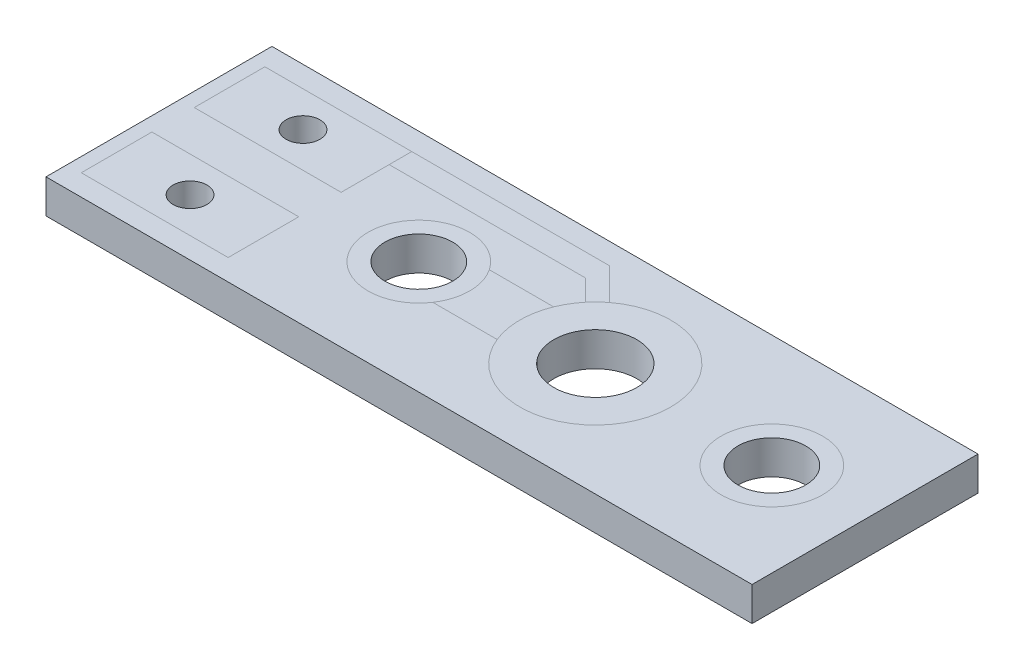
ISO-10303-21;
HEADER;
FILE_DESCRIPTION(('STEP AP214'),'2;1');
FILE_NAME('part.step','',(''),(''),'','','');
FILE_SCHEMA(('AUTOMOTIVE_DESIGN { 1 0 10303 214 1 1 1 1 }'));
ENDSEC;
DATA;
#1=APPLICATION_CONTEXT('core data for automotive mechanical design processes');
#2=APPLICATION_PROTOCOL_DEFINITION('international standard','automotive_design',2000,#1);
#3=PRODUCT_CONTEXT('',#1,'mechanical');
#4=PRODUCT('Part','Part','',(#3));
#5=PRODUCT_RELATED_PRODUCT_CATEGORY('part','',(#4));
#6=PRODUCT_DEFINITION_FORMATION('','',#4);
#7=PRODUCT_DEFINITION_CONTEXT('part definition',#1,'design');
#8=PRODUCT_DEFINITION('design','',#6,#7);
#9=PRODUCT_DEFINITION_SHAPE('','',#8);
#10=(LENGTH_UNIT() NAMED_UNIT(*) SI_UNIT(.MILLI.,.METRE.));
#11=(NAMED_UNIT(*) PLANE_ANGLE_UNIT() SI_UNIT($,.RADIAN.));
#12=(NAMED_UNIT(*) SI_UNIT($,.STERADIAN.) SOLID_ANGLE_UNIT());
#13=UNCERTAINTY_MEASURE_WITH_UNIT(LENGTH_MEASURE(1.E-05),#10,'distance_accuracy_value','');
#14=(GEOMETRIC_REPRESENTATION_CONTEXT(3) GLOBAL_UNCERTAINTY_ASSIGNED_CONTEXT((#13)) GLOBAL_UNIT_ASSIGNED_CONTEXT((#10,
#11,#12)) REPRESENTATION_CONTEXT('',''));
#15=CARTESIAN_POINT('',(0.,0.,0.));
#16=DIRECTION('',(0.,0.,1.));
#17=DIRECTION('',(1.,0.,0.));
#18=AXIS2_PLACEMENT_3D('',#15,#16,#17);
#19=CARTESIAN_POINT('',(0.,-0.762,0.));
#20=DIRECTION('',(0.,1.,0.));
#21=DIRECTION('',(0.,0.,-1.));
#22=AXIS2_PLACEMENT_3D('',#19,#20,#21);
#23=PLANE('',#22);
#24=DIRECTION('',(1.,0.,0.));
#25=VECTOR('',#24,1.);
#26=CARTESIAN_POINT('',(0.,-0.762,1.27));
#27=LINE('',#26,#25);
#28=CARTESIAN_POINT('',(6.89059014024725,-0.762,1.27));
#29=VERTEX_POINT('',#28);
#30=CARTESIAN_POINT('',(9.78323804751884,-0.762,1.27));
#31=VERTEX_POINT('',#30);
#32=EDGE_CURVE('E11',#29,#31,#27,.T.);
#33=ORIENTED_EDGE('',*,*,#32,.F.);
#34=CARTESIAN_POINT('',(3.7465,-0.762,0.));
#35=DIRECTION('',(0.,-1.,0.));
#36=DIRECTION('',(0.,0.,-1.));
#37=AXIS2_PLACEMENT_3D('',#34,#35,#36);
#38=CIRCLE('',#37,3.3909);
#39=CARTESIAN_POINT('',(6.89059014024725,-0.762,-1.27));
#40=VERTEX_POINT('',#39);
#41=EDGE_CURVE('E266',#29,#40,#38,.F.);
#42=ORIENTED_EDGE('',*,*,#41,.T.);
#43=DIRECTION('',(1.,0.,0.));
#44=VECTOR('',#43,1.);
#45=CARTESIAN_POINT('',(0.,-0.762,-1.27));
#46=LINE('',#45,#44);
#47=CARTESIAN_POINT('',(9.78323804751884,-0.762,-1.27));
#48=VERTEX_POINT('',#47);
#49=EDGE_CURVE('E53',#40,#48,#46,.T.);
#50=ORIENTED_EDGE('',*,*,#49,.T.);
#51=CARTESIAN_POINT('',(11.684,-0.762,0.));
#52=DIRECTION('',(0.,-1.,0.));
#53=DIRECTION('',(0.,0.,-1.));
#54=AXIS2_PLACEMENT_3D('',#51,#52,#53);
#55=CIRCLE('',#54,2.286);
#56=EDGE_CURVE('E267',#48,#31,#55,.F.);
#57=ORIENTED_EDGE('',*,*,#56,.T.);
#58=EDGE_LOOP('',(#33,#42,#50,#57));
#59=FACE_BOUND('',#58,.T.);
#60=ADVANCED_FACE('F44',(#59),#23,.F.);
#61=CARTESIAN_POINT('',(-4.191,-0.762,0.));
#62=DIRECTION('',(0.,-1.,0.));
#63=DIRECTION('',(0.,0.,-1.));
#64=AXIS2_PLACEMENT_3D('',#61,#62,#63);
#65=CIRCLE('',#64,2.286);
#66=CARTESIAN_POINT('',(-4.191,-0.762,-2.286));
#67=VERTEX_POINT('',#66);
#68=EDGE_CURVE('E257',#67,#67,#65,.F.);
#69=ORIENTED_EDGE('',*,*,#68,.T.);
#70=EDGE_LOOP('',(#69));
#71=FACE_BOUND('',#70,.T.);
#72=DIRECTION('',(-1.,0.,0.));
#73=VECTOR('',#72,1.);
#74=CARTESIAN_POINT('',(0.,-0.762,-0.952500000000002));
#75=LINE('',#74,#73);
#76=CARTESIAN_POINT('',(-8.636,-0.762,-0.952500000000002));
#77=VERTEX_POINT('',#76);
#78=CARTESIAN_POINT('',(-15.24,-0.762,-0.952500000000003));
#79=VERTEX_POINT('',#78);
#80=EDGE_CURVE('E250',#77,#79,#75,.T.);
#81=ORIENTED_EDGE('',*,*,#80,.F.);
#82=DIRECTION('',(0.,0.,1.));
#83=VECTOR('',#82,1.);
#84=CARTESIAN_POINT('',(-8.636,-0.762,0.));
#85=LINE('',#84,#83);
#86=CARTESIAN_POINT('',(-8.636,-0.762,-4.1275));
#87=VERTEX_POINT('',#86);
#88=EDGE_CURVE('E247',#87,#77,#85,.T.);
#89=ORIENTED_EDGE('',*,*,#88,.F.);
#90=DIRECTION('',(1.,0.,0.));
#91=VECTOR('',#90,1.);
#92=CARTESIAN_POINT('',(0.,-0.762,-4.1275));
#93=LINE('',#92,#91);
#94=CARTESIAN_POINT('',(-15.24,-0.762,-4.1275));
#95=VERTEX_POINT('',#94);
#96=EDGE_CURVE('E244',#95,#87,#93,.T.);
#97=ORIENTED_EDGE('',*,*,#96,.F.);
#98=DIRECTION('',(0.,0.,-1.));
#99=VECTOR('',#98,1.);
#100=CARTESIAN_POINT('',(-15.24,-0.762,0.));
#101=LINE('',#100,#99);
#102=EDGE_CURVE('E254',#79,#95,#101,.T.);
#103=ORIENTED_EDGE('',*,*,#102,.F.);
#104=EDGE_LOOP('',(#81,#89,#97,#103));
#105=FACE_BOUND('',#104,.T.);
#106=DIRECTION('',(0.,0.,1.));
#107=VECTOR('',#106,1.);
#108=CARTESIAN_POINT('',(-15.875,-0.762,-5.07999999999999));
#109=LINE('',#108,#107);
#110=CARTESIAN_POINT('',(-15.875,-0.762,-5.07999999999999));
#111=VERTEX_POINT('',#110);
#112=CARTESIAN_POINT('',(-15.875,-0.762,5.08));
#113=VERTEX_POINT('',#112);
#114=EDGE_CURVE('E204',#111,#113,#109,.T.);
#115=ORIENTED_EDGE('',*,*,#114,.F.);
#116=DIRECTION('',(-1.,0.,0.));
#117=VECTOR('',#116,1.);
#118=CARTESIAN_POINT('',(15.875,-0.762,-5.08));
#119=LINE('',#118,#117);
#120=CARTESIAN_POINT('',(15.875,-0.762,-5.08));
#121=VERTEX_POINT('',#120);
#122=EDGE_CURVE('E225',#121,#111,#119,.T.);
#123=ORIENTED_EDGE('',*,*,#122,.F.);
#124=DIRECTION('',(0.,0.,-1.));
#125=VECTOR('',#124,1.);
#126=CARTESIAN_POINT('',(15.875,-0.762,-5.08));
#127=LINE('',#126,#125);
#128=CARTESIAN_POINT('',(15.875,-0.762,5.08));
#129=VERTEX_POINT('',#128);
#130=EDGE_CURVE('E206',#129,#121,#127,.T.);
#131=ORIENTED_EDGE('',*,*,#130,.F.);
#132=DIRECTION('',(1.,0.,0.));
#133=VECTOR('',#132,1.);
#134=CARTESIAN_POINT('',(15.875,-0.762,5.08));
#135=LINE('',#134,#133);
#136=EDGE_CURVE('E189',#113,#129,#135,.T.);
#137=ORIENTED_EDGE('',*,*,#136,.F.);
#138=EDGE_LOOP('',(#115,#123,#131,#137));
#139=FACE_BOUND('',#138,.T.);
#140=CARTESIAN_POINT('',(1.68738577909666,-0.762,2.69411422090334));
#141=VERTEX_POINT('',#140);
#142=EDGE_CURVE('E262',#141,#29,#38,.F.);
#143=ORIENTED_EDGE('',*,*,#142,.T.);
#144=ORIENTED_EDGE('',*,*,#32,.T.);
#145=EDGE_CURVE('E265',#31,#48,#55,.F.);
#146=ORIENTED_EDGE('',*,*,#145,.T.);
#147=ORIENTED_EDGE('',*,*,#49,.F.);
#148=CARTESIAN_POINT('',(1.13769203312162,-0.762,2.16617723235008));
#149=VERTEX_POINT('',#148);
#150=EDGE_CURVE('E406',#40,#149,#38,.F.);
#151=ORIENTED_EDGE('',*,*,#150,.T.);
#152=DIRECTION('',(0.707106781186546,0.,-0.707106781186549));
#153=VECTOR('',#152,1.);
#154=CARTESIAN_POINT('',(1.65193463273585,-0.762,1.65193463273585));
#155=LINE('',#154,#153);
#156=CARTESIAN_POINT('',(0.192369265471702,-0.762,3.1115));
#157=VERTEX_POINT('',#156);
#158=EDGE_CURVE('E377',#157,#149,#155,.T.);
#159=ORIENTED_EDGE('',*,*,#158,.F.);
#160=DIRECTION('',(1.,0.,0.));
#161=VECTOR('',#160,1.);
#162=CARTESIAN_POINT('',(0.,-0.762,3.1115));
#163=LINE('',#162,#161);
#164=CARTESIAN_POINT('',(-8.636,-0.762,3.1115));
#165=VERTEX_POINT('',#164);
#166=EDGE_CURVE('E381',#165,#157,#163,.T.);
#167=ORIENTED_EDGE('',*,*,#166,.F.);
#168=DIRECTION('',(0.,0.,-1.));
#169=VECTOR('',#168,1.);
#170=CARTESIAN_POINT('',(-8.636,-0.762,0.));
#171=LINE('',#170,#169);
#172=CARTESIAN_POINT('',(-8.636,-0.762,0.952500000000002));
#173=VERTEX_POINT('',#172);
#174=EDGE_CURVE('E231',#165,#173,#171,.T.);
#175=ORIENTED_EDGE('',*,*,#174,.T.);
#176=DIRECTION('',(-1.,0.,0.));
#177=VECTOR('',#176,1.);
#178=CARTESIAN_POINT('',(0.,-0.762,0.952500000000002));
#179=LINE('',#178,#177);
#180=CARTESIAN_POINT('',(-15.24,-0.762,0.952500000000003));
#181=VERTEX_POINT('',#180);
#182=EDGE_CURVE('E228',#173,#181,#179,.T.);
#183=ORIENTED_EDGE('',*,*,#182,.T.);
#184=DIRECTION('',(0.,0.,1.));
#185=VECTOR('',#184,1.);
#186=CARTESIAN_POINT('',(-15.24,-0.762,0.));
#187=LINE('',#186,#185);
#188=CARTESIAN_POINT('',(-15.24,-0.762,4.1275));
#189=VERTEX_POINT('',#188);
#190=EDGE_CURVE('E240',#181,#189,#187,.T.);
#191=ORIENTED_EDGE('',*,*,#190,.T.);
#192=DIRECTION('',(1.,0.,0.));
#193=VECTOR('',#192,1.);
#194=CARTESIAN_POINT('',(0.,-0.762,4.1275));
#195=LINE('',#194,#193);
#196=CARTESIAN_POINT('',(-8.636,-0.762,4.1275));
#197=VERTEX_POINT('',#196);
#198=EDGE_CURVE('E236',#189,#197,#195,.T.);
#199=ORIENTED_EDGE('',*,*,#198,.T.);
#200=DIRECTION('',(1.,0.,0.));
#201=VECTOR('',#200,1.);
#202=CARTESIAN_POINT('',(0.,-0.762,4.1275));
#203=LINE('',#202,#201);
#204=CARTESIAN_POINT('',(0.254000000000001,-0.762,4.1275));
#205=VERTEX_POINT('',#204);
#206=EDGE_CURVE('E374',#197,#205,#203,.T.);
#207=ORIENTED_EDGE('',*,*,#206,.T.);
#208=DIRECTION('',(0.707106781186546,0.,-0.707106781186549));
#209=VECTOR('',#208,1.);
#210=CARTESIAN_POINT('',(2.19075,-0.762,2.19074999999999));
#211=LINE('',#210,#209);
#212=EDGE_CURVE('E370',#205,#141,#211,.T.);
#213=ORIENTED_EDGE('',*,*,#212,.T.);
#214=EDGE_LOOP('',(#143,#144,#146,#147,#151,#159,#167,#175,#183,#191,#199,#207,#213));
#215=FACE_BOUND('',#214,.T.);
#216=ADVANCED_FACE('F202',(#71,#105,#139,#215),#23,.F.);
#217=CARTESIAN_POINT('',(0.,0.762,0.));
#218=DIRECTION('',(0.,-1.,0.));
#219=DIRECTION('',(0.,0.,-1.));
#220=AXIS2_PLACEMENT_3D('',#217,#218,#219);
#221=PLANE('',#220);
#222=DIRECTION('',(0.,0.,1.));
#223=VECTOR('',#222,1.);
#224=CARTESIAN_POINT('',(-15.24,0.762,0.));
#225=LINE('',#224,#223);
#226=CARTESIAN_POINT('',(-15.24,0.762,0.952500000000003));
#227=VERTEX_POINT('',#226);
#228=CARTESIAN_POINT('',(-15.24,0.762,4.1275));
#229=VERTEX_POINT('',#228);
#230=EDGE_CURVE('E317',#227,#229,#225,.T.);
#231=ORIENTED_EDGE('',*,*,#230,.F.);
#232=DIRECTION('',(-1.,0.,0.));
#233=VECTOR('',#232,1.);
#234=CARTESIAN_POINT('',(0.,0.762,0.952500000000002));
#235=LINE('',#234,#233);
#236=CARTESIAN_POINT('',(-8.636,0.762,0.952500000000002));
#237=VERTEX_POINT('',#236);
#238=EDGE_CURVE('E197',#237,#227,#235,.T.);
#239=ORIENTED_EDGE('',*,*,#238,.F.);
#240=DIRECTION('',(0.,0.,-1.));
#241=VECTOR('',#240,1.);
#242=CARTESIAN_POINT('',(-8.636,0.762,0.));
#243=LINE('',#242,#241);
#244=CARTESIAN_POINT('',(-8.636,0.762,4.1275));
#245=VERTEX_POINT('',#244);
#246=EDGE_CURVE('E311',#245,#237,#243,.T.);
#247=ORIENTED_EDGE('',*,*,#246,.F.);
#248=DIRECTION('',(1.,0.,0.));
#249=VECTOR('',#248,1.);
#250=CARTESIAN_POINT('',(0.,0.762,4.1275));
#251=LINE('',#250,#249);
#252=EDGE_CURVE('E314',#229,#245,#251,.T.);
#253=ORIENTED_EDGE('',*,*,#252,.F.);
#254=EDGE_LOOP('',(#231,#239,#247,#253));
#255=FACE_BOUND('',#254,.T.);
#256=DIRECTION('',(0.,0.,1.));
#257=VECTOR('',#256,1.);
#258=CARTESIAN_POINT('',(-15.875,0.762,-5.07999999999999));
#259=LINE('',#258,#257);
#260=CARTESIAN_POINT('',(-15.875,0.762,-5.07999999999999));
#261=VERTEX_POINT('',#260);
#262=CARTESIAN_POINT('',(-15.875,0.762,5.08));
#263=VERTEX_POINT('',#262);
#264=EDGE_CURVE('E283',#261,#263,#259,.T.);
#265=ORIENTED_EDGE('',*,*,#264,.T.);
#266=DIRECTION('',(1.,0.,0.));
#267=VECTOR('',#266,1.);
#268=CARTESIAN_POINT('',(15.875,0.762,5.08));
#269=LINE('',#268,#267);
#270=CARTESIAN_POINT('',(15.875,0.762,5.08));
#271=VERTEX_POINT('',#270);
#272=EDGE_CURVE('E191',#263,#271,#269,.T.);
#273=ORIENTED_EDGE('',*,*,#272,.T.);
#274=DIRECTION('',(0.,0.,-1.));
#275=VECTOR('',#274,1.);
#276=CARTESIAN_POINT('',(15.875,0.762,-5.08));
#277=LINE('',#276,#275);
#278=CARTESIAN_POINT('',(15.875,0.762,-5.08));
#279=VERTEX_POINT('',#278);
#280=EDGE_CURVE('E295',#271,#279,#277,.T.);
#281=ORIENTED_EDGE('',*,*,#280,.T.);
#282=DIRECTION('',(-1.,0.,0.));
#283=VECTOR('',#282,1.);
#284=CARTESIAN_POINT('',(15.875,0.762,-5.08));
#285=LINE('',#284,#283);
#286=EDGE_CURVE('E298',#279,#261,#285,.T.);
#287=ORIENTED_EDGE('',*,*,#286,.T.);
#288=EDGE_LOOP('',(#265,#273,#281,#287));
#289=FACE_BOUND('',#288,.T.);
#290=CARTESIAN_POINT('',(11.684,0.762,0.));
#291=DIRECTION('',(0.,-1.,0.));
#292=DIRECTION('',(0.,0.,-1.));
#293=AXIS2_PLACEMENT_3D('',#290,#291,#292);
#294=CIRCLE('',#293,2.286);
#295=CARTESIAN_POINT('',(11.684,0.762,-2.286));
#296=VERTEX_POINT('',#295);
#297=EDGE_CURVE('E346',#296,#296,#294,.F.);
#298=ORIENTED_EDGE('',*,*,#297,.F.);
#299=EDGE_LOOP('',(#298));
#300=FACE_BOUND('',#299,.T.);
#301=DIRECTION('',(1.,0.,0.));
#302=VECTOR('',#301,1.);
#303=CARTESIAN_POINT('',(0.,0.762,-3.1115));
#304=LINE('',#303,#302);
#305=CARTESIAN_POINT('',(-8.636,0.762,-3.1115));
#306=VERTEX_POINT('',#305);
#307=CARTESIAN_POINT('',(0.192369265471702,0.762,-3.1115));
#308=VERTEX_POINT('',#307);
#309=EDGE_CURVE('E367',#306,#308,#304,.T.);
#310=ORIENTED_EDGE('',*,*,#309,.F.);
#311=DIRECTION('',(0.,0.,1.));
#312=VECTOR('',#311,1.);
#313=CARTESIAN_POINT('',(-8.636,0.762,0.));
#314=LINE('',#313,#312);
#315=CARTESIAN_POINT('',(-8.636,0.762,-0.952500000000002));
#316=VERTEX_POINT('',#315);
#317=EDGE_CURVE('E324',#306,#316,#314,.T.);
#318=ORIENTED_EDGE('',*,*,#317,.T.);
#319=DIRECTION('',(-1.,0.,0.));
#320=VECTOR('',#319,1.);
#321=CARTESIAN_POINT('',(0.,0.762,-0.952500000000002));
#322=LINE('',#321,#320);
#323=CARTESIAN_POINT('',(-15.24,0.762,-0.952500000000003));
#324=VERTEX_POINT('',#323);
#325=EDGE_CURVE('E329',#316,#324,#322,.T.);
#326=ORIENTED_EDGE('',*,*,#325,.T.);
#327=DIRECTION('',(0.,0.,-1.));
#328=VECTOR('',#327,1.);
#329=CARTESIAN_POINT('',(-15.24,0.762,0.));
#330=LINE('',#329,#328);
#331=CARTESIAN_POINT('',(-15.24,0.762,-4.1275));
#332=VERTEX_POINT('',#331);
#333=EDGE_CURVE('E333',#324,#332,#330,.T.);
#334=ORIENTED_EDGE('',*,*,#333,.T.);
#335=DIRECTION('',(1.,0.,0.));
#336=VECTOR('',#335,1.);
#337=CARTESIAN_POINT('',(0.,0.762,-4.1275));
#338=LINE('',#337,#336);
#339=CARTESIAN_POINT('',(-8.636,0.762,-4.1275));
#340=VERTEX_POINT('',#339);
#341=EDGE_CURVE('E320',#332,#340,#338,.T.);
#342=ORIENTED_EDGE('',*,*,#341,.T.);
#343=DIRECTION('',(1.,0.,0.));
#344=VECTOR('',#343,1.);
#345=CARTESIAN_POINT('',(0.,0.762,-4.1275));
#346=LINE('',#345,#344);
#347=CARTESIAN_POINT('',(0.254000000000002,0.762,-4.1275));
#348=VERTEX_POINT('',#347);
#349=EDGE_CURVE('E361',#340,#348,#346,.T.);
#350=ORIENTED_EDGE('',*,*,#349,.T.);
#351=DIRECTION('',(0.707106781186546,0.,0.707106781186549));
#352=VECTOR('',#351,1.);
#353=CARTESIAN_POINT('',(2.19075,0.762,-2.19075));
#354=LINE('',#353,#352);
#355=CARTESIAN_POINT('',(1.68738577909666,0.762,-2.69411422090334));
#356=VERTEX_POINT('',#355);
#357=EDGE_CURVE('E358',#348,#356,#354,.T.);
#358=ORIENTED_EDGE('',*,*,#357,.T.);
#359=CARTESIAN_POINT('',(3.7465,0.762,0.));
#360=DIRECTION('',(0.,-1.,0.));
#361=DIRECTION('',(0.,0.,-1.));
#362=AXIS2_PLACEMENT_3D('',#359,#360,#361);
#363=CIRCLE('',#362,3.3909);
#364=CARTESIAN_POINT('',(0.602409859752746,0.762,1.27));
#365=VERTEX_POINT('',#364);
#366=EDGE_CURVE('E347',#365,#356,#363,.F.);
#367=ORIENTED_EDGE('',*,*,#366,.F.);
#368=DIRECTION('',(1.,0.,0.));
#369=VECTOR('',#368,1.);
#370=CARTESIAN_POINT('',(0.,0.762,1.27));
#371=LINE('',#370,#369);
#372=CARTESIAN_POINT('',(-2.29023804751884,0.762,1.27));
#373=VERTEX_POINT('',#372);
#374=EDGE_CURVE('E355',#373,#365,#371,.T.);
#375=ORIENTED_EDGE('',*,*,#374,.F.);
#376=CARTESIAN_POINT('',(-4.191,0.762,0.));
#377=DIRECTION('',(0.,-1.,0.));
#378=DIRECTION('',(0.,0.,-1.));
#379=AXIS2_PLACEMENT_3D('',#376,#377,#378);
#380=CIRCLE('',#379,2.286);
#381=CARTESIAN_POINT('',(-2.29023804751884,0.762,-1.27));
#382=VERTEX_POINT('',#381);
#383=EDGE_CURVE('E337',#382,#373,#380,.F.);
#384=ORIENTED_EDGE('',*,*,#383,.F.);
#385=DIRECTION('',(1.,0.,0.));
#386=VECTOR('',#385,1.);
#387=CARTESIAN_POINT('',(0.,0.762,-1.27));
#388=LINE('',#387,#386);
#389=CARTESIAN_POINT('',(0.602409859752746,0.762,-1.27));
#390=VERTEX_POINT('',#389);
#391=EDGE_CURVE('E351',#382,#390,#388,.T.);
#392=ORIENTED_EDGE('',*,*,#391,.T.);
#393=CARTESIAN_POINT('',(1.13769203312162,0.762,-2.16617723235008));
#394=VERTEX_POINT('',#393);
#395=EDGE_CURVE('E341',#394,#390,#363,.F.);
#396=ORIENTED_EDGE('',*,*,#395,.F.);
#397=DIRECTION('',(0.707106781186546,0.,0.707106781186549));
#398=VECTOR('',#397,1.);
#399=CARTESIAN_POINT('',(1.65193463273585,0.762,-1.65193463273584));
#400=LINE('',#399,#398);
#401=EDGE_CURVE('E364',#308,#394,#400,.T.);
#402=ORIENTED_EDGE('',*,*,#401,.F.);
#403=EDGE_LOOP('',(#310,#318,#326,#334,#342,#350,#358,#367,#375,#384,#392,#396,#402));
#404=FACE_BOUND('',#403,.T.);
#405=ADVANCED_FACE('F493',(#255,#289,#300,#404),#221,.F.);
#406=EDGE_CURVE('E325',#340,#306,#314,.T.);
#407=ORIENTED_EDGE('',*,*,#406,.T.);
#408=ORIENTED_EDGE('',*,*,#309,.T.);
#409=ORIENTED_EDGE('',*,*,#401,.T.);
#410=EDGE_CURVE('E805',#356,#394,#363,.F.);
#411=ORIENTED_EDGE('',*,*,#410,.F.);
#412=ORIENTED_EDGE('',*,*,#357,.F.);
#413=ORIENTED_EDGE('',*,*,#349,.F.);
#414=EDGE_LOOP('',(#407,#408,#409,#411,#412,#413));
#415=FACE_BOUND('',#414,.T.);
#416=ADVANCED_FACE('F499',(#415),#221,.F.);
#417=EDGE_CURVE('E336',#373,#382,#380,.F.);
#418=ORIENTED_EDGE('',*,*,#417,.F.);
#419=ORIENTED_EDGE('',*,*,#374,.T.);
#420=EDGE_CURVE('E342',#390,#365,#363,.F.);
#421=ORIENTED_EDGE('',*,*,#420,.F.);
#422=ORIENTED_EDGE('',*,*,#391,.F.);
#423=EDGE_LOOP('',(#418,#419,#421,#422));
#424=FACE_BOUND('',#423,.T.);
#425=ADVANCED_FACE('F630',(#424),#221,.F.);
#426=ORIENTED_EDGE('',*,*,#297,.T.);
#427=EDGE_LOOP('',(#426));
#428=FACE_BOUND('',#427,.T.);
#429=CARTESIAN_POINT('',(11.684,0.762,0.));
#430=DIRECTION('',(0.,1.,0.));
#431=DIRECTION('',(0.,0.,1.));
#432=AXIS2_PLACEMENT_3D('',#429,#430,#431);
#433=CIRCLE('',#432,1.524);
#434=CARTESIAN_POINT('',(11.684,0.762,1.524));
#435=VERTEX_POINT('',#434);
#436=EDGE_CURVE('E278',#435,#435,#433,.T.);
#437=ORIENTED_EDGE('',*,*,#436,.F.);
#438=EDGE_LOOP('',(#437));
#439=FACE_BOUND('',#438,.T.);
#440=ADVANCED_FACE('F623',(#428,#439),#221,.F.);
#441=ORIENTED_EDGE('',*,*,#420,.T.);
#442=ORIENTED_EDGE('',*,*,#366,.T.);
#443=ORIENTED_EDGE('',*,*,#410,.T.);
#444=ORIENTED_EDGE('',*,*,#395,.T.);
#445=EDGE_LOOP('',(#441,#442,#443,#444));
#446=FACE_BOUND('',#445,.T.);
#447=CARTESIAN_POINT('',(3.7465,0.762,0.));
#448=DIRECTION('',(0.,1.,0.));
#449=DIRECTION('',(0.,0.,1.));
#450=AXIS2_PLACEMENT_3D('',#447,#448,#449);
#451=CIRCLE('',#450,1.8669);
#452=CARTESIAN_POINT('',(3.7465,0.762,1.8669));
#453=VERTEX_POINT('',#452);
#454=EDGE_CURVE('E284',#453,#453,#451,.T.);
#455=ORIENTED_EDGE('',*,*,#454,.F.);
#456=EDGE_LOOP('',(#455));
#457=FACE_BOUND('',#456,.T.);
#458=ADVANCED_FACE('F552',(#446,#457),#221,.F.);
#459=CARTESIAN_POINT('',(-11.938,0.762,-2.54));
#460=DIRECTION('',(0.,-1.,0.));
#461=DIRECTION('',(0.,0.,-1.));
#462=AXIS2_PLACEMENT_3D('',#459,#460,#461);
#463=CIRCLE('',#462,0.762000000000001);
#464=CARTESIAN_POINT('',(-11.938,0.762,-3.302));
#465=VERTEX_POINT('',#464);
#466=EDGE_CURVE('E270',#465,#465,#463,.T.);
#467=ORIENTED_EDGE('',*,*,#466,.T.);
#468=EDGE_LOOP('',(#467));
#469=FACE_BOUND('',#468,.T.);
#470=ORIENTED_EDGE('',*,*,#333,.F.);
#471=ORIENTED_EDGE('',*,*,#325,.F.);
#472=ORIENTED_EDGE('',*,*,#317,.F.);
#473=ORIENTED_EDGE('',*,*,#406,.F.);
#474=ORIENTED_EDGE('',*,*,#341,.F.);
#475=EDGE_LOOP('',(#470,#471,#472,#473,#474));
#476=FACE_BOUND('',#475,.T.);
#477=ADVANCED_FACE('F547',(#469,#476),#221,.F.);
#478=ORIENTED_EDGE('',*,*,#383,.T.);
#479=ORIENTED_EDGE('',*,*,#417,.T.);
#480=EDGE_LOOP('',(#478,#479));
#481=FACE_BOUND('',#480,.T.);
#482=CARTESIAN_POINT('',(-4.191,0.762,0.));
#483=DIRECTION('',(0.,1.,0.));
#484=DIRECTION('',(0.,0.,1.));
#485=AXIS2_PLACEMENT_3D('',#482,#483,#484);
#486=CIRCLE('',#485,1.524);
#487=CARTESIAN_POINT('',(-4.191,0.762,1.524));
#488=VERTEX_POINT('',#487);
#489=EDGE_CURVE('E279',#488,#488,#486,.T.);
#490=ORIENTED_EDGE('',*,*,#489,.F.);
#491=EDGE_LOOP('',(#490));
#492=FACE_BOUND('',#491,.T.);
#493=ADVANCED_FACE('F533',(#481,#492),#221,.F.);
#494=CARTESIAN_POINT('',(-15.875,0.762,-5.07999999999999));
#495=DIRECTION('',(1.,0.,0.));
#496=DIRECTION('',(0.,0.,-1.));
#497=AXIS2_PLACEMENT_3D('',#494,#495,#496);
#498=PLANE('',#497);
#499=DIRECTION('',(0.,-1.,0.));
#500=VECTOR('',#499,1.);
#501=CARTESIAN_POINT('',(-15.875,0.762,-5.07999999999999));
#502=LINE('',#501,#500);
#503=EDGE_CURVE('E210',#261,#111,#502,.T.);
#504=ORIENTED_EDGE('',*,*,#503,.T.);
#505=ORIENTED_EDGE('',*,*,#114,.T.);
#506=DIRECTION('',(0.,-1.,0.));
#507=VECTOR('',#506,1.);
#508=CARTESIAN_POINT('',(-15.875,0.762,5.08));
#509=LINE('',#508,#507);
#510=EDGE_CURVE('E185',#263,#113,#509,.T.);
#511=ORIENTED_EDGE('',*,*,#510,.F.);
#512=ORIENTED_EDGE('',*,*,#264,.F.);
#513=EDGE_LOOP('',(#504,#505,#511,#512));
#514=FACE_BOUND('',#513,.T.);
#515=ADVANCED_FACE('F46',(#514),#498,.F.);
#516=CARTESIAN_POINT('',(15.875,0.762,5.08));
#517=DIRECTION('',(0.,0.,-1.));
#518=DIRECTION('',(-1.,0.,0.));
#519=AXIS2_PLACEMENT_3D('',#516,#517,#518);
#520=PLANE('',#519);
#521=ORIENTED_EDGE('',*,*,#510,.T.);
#522=ORIENTED_EDGE('',*,*,#136,.T.);
#523=DIRECTION('',(0.,-1.,0.));
#524=VECTOR('',#523,1.);
#525=CARTESIAN_POINT('',(15.875,0.762,5.08));
#526=LINE('',#525,#524);
#527=EDGE_CURVE('E198',#271,#129,#526,.T.);
#528=ORIENTED_EDGE('',*,*,#527,.F.);
#529=ORIENTED_EDGE('',*,*,#272,.F.);
#530=EDGE_LOOP('',(#521,#522,#528,#529));
#531=FACE_BOUND('',#530,.T.);
#532=ADVANCED_FACE('F187',(#531),#520,.F.);
#533=CARTESIAN_POINT('',(15.875,0.762,-5.08));
#534=DIRECTION('',(-1.,0.,0.));
#535=DIRECTION('',(0.,0.,1.));
#536=AXIS2_PLACEMENT_3D('',#533,#534,#535);
#537=PLANE('',#536);
#538=ORIENTED_EDGE('',*,*,#527,.T.);
#539=ORIENTED_EDGE('',*,*,#130,.T.);
#540=DIRECTION('',(0.,-1.,0.));
#541=VECTOR('',#540,1.);
#542=CARTESIAN_POINT('',(15.875,0.762,-5.08));
#543=LINE('',#542,#541);
#544=EDGE_CURVE('E303',#279,#121,#543,.T.);
#545=ORIENTED_EDGE('',*,*,#544,.F.);
#546=ORIENTED_EDGE('',*,*,#280,.F.);
#547=EDGE_LOOP('',(#538,#539,#545,#546));
#548=FACE_BOUND('',#547,.T.);
#549=ADVANCED_FACE('F536',(#548),#537,.F.);
#550=CARTESIAN_POINT('',(15.875,0.762,-5.08));
#551=DIRECTION('',(0.,0.,1.));
#552=DIRECTION('',(1.,0.,0.));
#553=AXIS2_PLACEMENT_3D('',#550,#551,#552);
#554=PLANE('',#553);
#555=ORIENTED_EDGE('',*,*,#544,.T.);
#556=ORIENTED_EDGE('',*,*,#122,.T.);
#557=ORIENTED_EDGE('',*,*,#503,.F.);
#558=ORIENTED_EDGE('',*,*,#286,.F.);
#559=EDGE_LOOP('',(#555,#556,#557,#558));
#560=FACE_BOUND('',#559,.T.);
#561=ADVANCED_FACE('F531',(#560),#554,.F.);
#562=ORIENTED_EDGE('',*,*,#238,.T.);
#563=ORIENTED_EDGE('',*,*,#230,.T.);
#564=ORIENTED_EDGE('',*,*,#252,.T.);
#565=ORIENTED_EDGE('',*,*,#246,.T.);
#566=EDGE_LOOP('',(#562,#563,#564,#565));
#567=FACE_BOUND('',#566,.T.);
#568=CARTESIAN_POINT('',(-11.938,0.762,2.54));
#569=DIRECTION('',(0.,1.,0.));
#570=DIRECTION('',(0.,0.,1.));
#571=AXIS2_PLACEMENT_3D('',#568,#569,#570);
#572=CIRCLE('',#571,0.762000000000001);
#573=CARTESIAN_POINT('',(-11.938,0.762,3.302));
#574=VERTEX_POINT('',#573);
#575=EDGE_CURVE('E274',#574,#574,#572,.T.);
#576=ORIENTED_EDGE('',*,*,#575,.F.);
#577=EDGE_LOOP('',(#576));
#578=FACE_BOUND('',#577,.T.);
#579=ADVANCED_FACE('F502',(#567,#578),#221,.F.);
#580=CARTESIAN_POINT('',(11.684,0.,0.));
#581=DIRECTION('',(0.,1.,0.));
#582=DIRECTION('',(0.,0.,1.));
#583=AXIS2_PLACEMENT_3D('',#580,#581,#582);
#584=CYLINDRICAL_SURFACE('',#583,1.524);
#585=ORIENTED_EDGE('',*,*,#436,.T.);
#586=EDGE_LOOP('',(#585));
#587=FACE_BOUND('',#586,.T.);
#588=CARTESIAN_POINT('',(11.684,-0.762,0.));
#589=DIRECTION('',(0.,1.,0.));
#590=DIRECTION('',(0.,0.,1.));
#591=AXIS2_PLACEMENT_3D('',#588,#589,#590);
#592=CIRCLE('',#591,1.524);
#593=CARTESIAN_POINT('',(11.684,-0.762,1.524));
#594=VERTEX_POINT('',#593);
#595=EDGE_CURVE('E220',#594,#594,#592,.T.);
#596=ORIENTED_EDGE('',*,*,#595,.F.);
#597=EDGE_LOOP('',(#596));
#598=FACE_BOUND('',#597,.T.);
#599=ADVANCED_FACE('F525',(#587,#598),#584,.F.);
#600=CARTESIAN_POINT('',(3.7465,0.,0.));
#601=DIRECTION('',(0.,1.,0.));
#602=DIRECTION('',(0.,0.,1.));
#603=AXIS2_PLACEMENT_3D('',#600,#601,#602);
#604=CYLINDRICAL_SURFACE('',#603,1.8669);
#605=ORIENTED_EDGE('',*,*,#454,.T.);
#606=EDGE_LOOP('',(#605));
#607=FACE_BOUND('',#606,.T.);
#608=CARTESIAN_POINT('',(3.7465,-0.762,0.));
#609=DIRECTION('',(0.,1.,0.));
#610=DIRECTION('',(0.,0.,1.));
#611=AXIS2_PLACEMENT_3D('',#608,#609,#610);
#612=CIRCLE('',#611,1.8669);
#613=CARTESIAN_POINT('',(3.7465,-0.762,1.8669));
#614=VERTEX_POINT('',#613);
#615=EDGE_CURVE('E217',#614,#614,#612,.T.);
#616=ORIENTED_EDGE('',*,*,#615,.F.);
#617=EDGE_LOOP('',(#616));
#618=FACE_BOUND('',#617,.T.);
#619=ADVANCED_FACE('F521',(#607,#618),#604,.F.);
#620=CARTESIAN_POINT('',(-4.191,0.,0.));
#621=DIRECTION('',(0.,1.,0.));
#622=DIRECTION('',(0.,0.,1.));
#623=AXIS2_PLACEMENT_3D('',#620,#621,#622);
#624=CYLINDRICAL_SURFACE('',#623,1.524);
#625=ORIENTED_EDGE('',*,*,#489,.T.);
#626=EDGE_LOOP('',(#625));
#627=FACE_BOUND('',#626,.T.);
#628=CARTESIAN_POINT('',(-4.191,-0.762,0.));
#629=DIRECTION('',(0.,1.,0.));
#630=DIRECTION('',(0.,0.,1.));
#631=AXIS2_PLACEMENT_3D('',#628,#629,#630);
#632=CIRCLE('',#631,1.524);
#633=CARTESIAN_POINT('',(-4.191,-0.762,1.524));
#634=VERTEX_POINT('',#633);
#635=EDGE_CURVE('E213',#634,#634,#632,.T.);
#636=ORIENTED_EDGE('',*,*,#635,.F.);
#637=EDGE_LOOP('',(#636));
#638=FACE_BOUND('',#637,.T.);
#639=ADVANCED_FACE('F514',(#627,#638),#624,.F.);
#640=CARTESIAN_POINT('',(-11.938,0.,2.54));
#641=DIRECTION('',(0.,1.,0.));
#642=DIRECTION('',(0.,0.,1.));
#643=AXIS2_PLACEMENT_3D('',#640,#641,#642);
#644=CYLINDRICAL_SURFACE('',#643,0.762000000000001);
#645=ORIENTED_EDGE('',*,*,#575,.T.);
#646=EDGE_LOOP('',(#645));
#647=FACE_BOUND('',#646,.T.);
#648=CARTESIAN_POINT('',(-11.938,-0.762,2.54));
#649=DIRECTION('',(0.,1.,0.));
#650=DIRECTION('',(0.,0.,1.));
#651=AXIS2_PLACEMENT_3D('',#648,#649,#650);
#652=CIRCLE('',#651,0.762000000000001);
#653=CARTESIAN_POINT('',(-11.938,-0.762,3.302));
#654=VERTEX_POINT('',#653);
#655=EDGE_CURVE('E473',#654,#654,#652,.T.);
#656=ORIENTED_EDGE('',*,*,#655,.F.);
#657=EDGE_LOOP('',(#656));
#658=FACE_BOUND('',#657,.T.);
#659=ADVANCED_FACE('F509',(#647,#658),#644,.F.);
#660=CARTESIAN_POINT('',(-11.938,0.,-2.54));
#661=DIRECTION('',(0.,1.,0.));
#662=DIRECTION('',(0.,0.,1.));
#663=AXIS2_PLACEMENT_3D('',#660,#661,#662);
#664=CYLINDRICAL_SURFACE('',#663,0.762000000000001);
#665=ORIENTED_EDGE('',*,*,#466,.F.);
#666=EDGE_LOOP('',(#665));
#667=FACE_BOUND('',#666,.T.);
#668=CARTESIAN_POINT('',(-11.938,-0.762,-2.54));
#669=DIRECTION('',(0.,-1.,0.));
#670=DIRECTION('',(0.,0.,-1.));
#671=AXIS2_PLACEMENT_3D('',#668,#669,#670);
#672=CIRCLE('',#671,0.762000000000001);
#673=CARTESIAN_POINT('',(-11.938,-0.762,-3.302));
#674=VERTEX_POINT('',#673);
#675=EDGE_CURVE('E478',#674,#674,#672,.T.);
#676=ORIENTED_EDGE('',*,*,#675,.T.);
#677=EDGE_LOOP('',(#676));
#678=FACE_BOUND('',#677,.T.);
#679=ADVANCED_FACE('F483',(#667,#678),#664,.F.);
#680=EDGE_CURVE('E232',#197,#165,#171,.T.);
#681=ORIENTED_EDGE('',*,*,#680,.T.);
#682=ORIENTED_EDGE('',*,*,#166,.T.);
#683=ORIENTED_EDGE('',*,*,#158,.T.);
#684=EDGE_CURVE('E261',#149,#141,#38,.F.);
#685=ORIENTED_EDGE('',*,*,#684,.T.);
#686=ORIENTED_EDGE('',*,*,#212,.F.);
#687=ORIENTED_EDGE('',*,*,#206,.F.);
#688=EDGE_LOOP('',(#681,#682,#683,#685,#686,#687));
#689=FACE_BOUND('',#688,.T.);
#690=ADVANCED_FACE('F459',(#689),#23,.F.);
#691=ORIENTED_EDGE('',*,*,#56,.F.);
#692=ORIENTED_EDGE('',*,*,#145,.F.);
#693=EDGE_LOOP('',(#691,#692));
#694=FACE_BOUND('',#693,.T.);
#695=ORIENTED_EDGE('',*,*,#595,.T.);
#696=EDGE_LOOP('',(#695));
#697=FACE_BOUND('',#696,.T.);
#698=ADVANCED_FACE('F390',(#694,#697),#23,.F.);
#699=ORIENTED_EDGE('',*,*,#142,.F.);
#700=ORIENTED_EDGE('',*,*,#684,.F.);
#701=ORIENTED_EDGE('',*,*,#150,.F.);
#702=ORIENTED_EDGE('',*,*,#41,.F.);
#703=EDGE_LOOP('',(#699,#700,#701,#702));
#704=FACE_BOUND('',#703,.T.);
#705=ORIENTED_EDGE('',*,*,#615,.T.);
#706=EDGE_LOOP('',(#705));
#707=FACE_BOUND('',#706,.T.);
#708=ADVANCED_FACE('F462',(#704,#707),#23,.F.);
#709=ORIENTED_EDGE('',*,*,#675,.F.);
#710=EDGE_LOOP('',(#709));
#711=FACE_BOUND('',#710,.T.);
#712=ORIENTED_EDGE('',*,*,#102,.T.);
#713=ORIENTED_EDGE('',*,*,#96,.T.);
#714=ORIENTED_EDGE('',*,*,#88,.T.);
#715=ORIENTED_EDGE('',*,*,#80,.T.);
#716=EDGE_LOOP('',(#712,#713,#714,#715));
#717=FACE_BOUND('',#716,.T.);
#718=ADVANCED_FACE('F465',(#711,#717),#23,.F.);
#719=ORIENTED_EDGE('',*,*,#68,.F.);
#720=EDGE_LOOP('',(#719));
#721=FACE_BOUND('',#720,.T.);
#722=ORIENTED_EDGE('',*,*,#635,.T.);
#723=EDGE_LOOP('',(#722));
#724=FACE_BOUND('',#723,.T.);
#725=ADVANCED_FACE('F487',(#721,#724),#23,.F.);
#726=ORIENTED_EDGE('',*,*,#182,.F.);
#727=ORIENTED_EDGE('',*,*,#174,.F.);
#728=ORIENTED_EDGE('',*,*,#680,.F.);
#729=ORIENTED_EDGE('',*,*,#198,.F.);
#730=ORIENTED_EDGE('',*,*,#190,.F.);
#731=EDGE_LOOP('',(#726,#727,#728,#729,#730));
#732=FACE_BOUND('',#731,.T.);
#733=ORIENTED_EDGE('',*,*,#655,.T.);
#734=EDGE_LOOP('',(#733));
#735=FACE_BOUND('',#734,.T.);
#736=ADVANCED_FACE('F454',(#732,#735),#23,.F.);
#737=CLOSED_SHELL('',(#60,#216,#405,#416,#425,#440,#458,#477,#493,#515,#532,#549,#561,#579,#599,
#619,#639,#659,#679,#690,#698,#708,#718,#725,#736));
#738=MANIFOLD_SOLID_BREP('B2',#737);
#739=ADVANCED_BREP_SHAPE_REPRESENTATION('',(#18,#738),#14);
#740=SHAPE_DEFINITION_REPRESENTATION(#9,#739);
ENDSEC;
END-ISO-10303-21;
